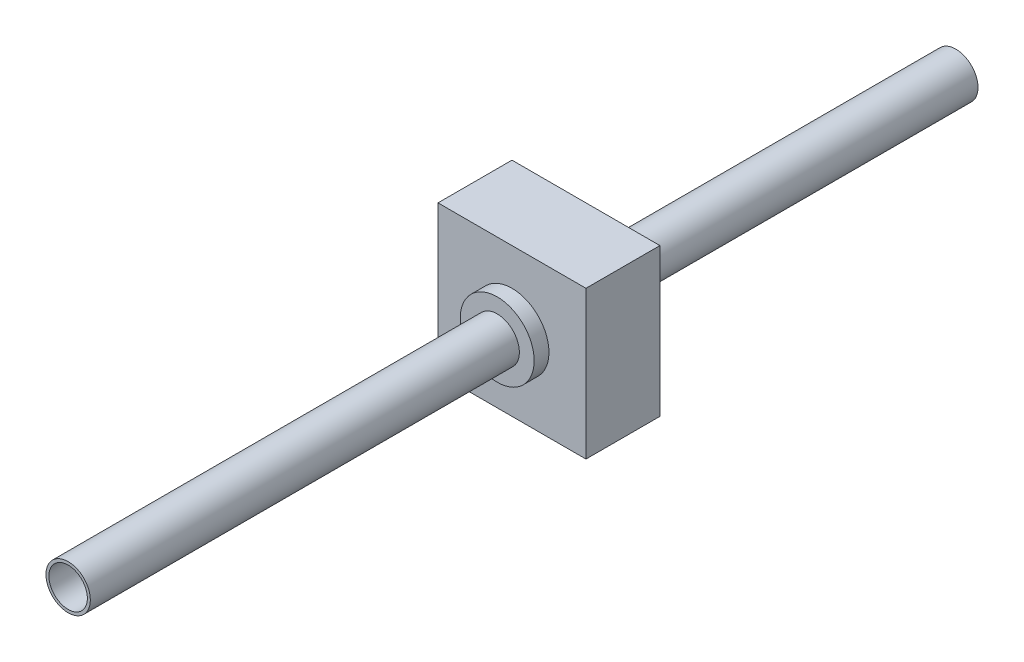
ISO-10303-21;
HEADER;
FILE_DESCRIPTION(('STEP AP214'),'2;1');
FILE_NAME('part.step','',(''),(''),'','','');
FILE_SCHEMA(('AUTOMOTIVE_DESIGN { 1 0 10303 214 1 1 1 1 }'));
ENDSEC;
DATA;
#1=APPLICATION_CONTEXT('core data for automotive mechanical design processes');
#2=APPLICATION_PROTOCOL_DEFINITION('international standard','automotive_design',2000,#1);
#3=PRODUCT_CONTEXT('',#1,'mechanical');
#4=PRODUCT('Part','Part','',(#3));
#5=PRODUCT_RELATED_PRODUCT_CATEGORY('part','',(#4));
#6=PRODUCT_DEFINITION_FORMATION('','',#4);
#7=PRODUCT_DEFINITION_CONTEXT('part definition',#1,'design');
#8=PRODUCT_DEFINITION('design','',#6,#7);
#9=PRODUCT_DEFINITION_SHAPE('','',#8);
#10=(LENGTH_UNIT() NAMED_UNIT(*) SI_UNIT(.MILLI.,.METRE.));
#11=(NAMED_UNIT(*) PLANE_ANGLE_UNIT() SI_UNIT($,.RADIAN.));
#12=(NAMED_UNIT(*) SI_UNIT($,.STERADIAN.) SOLID_ANGLE_UNIT());
#13=UNCERTAINTY_MEASURE_WITH_UNIT(LENGTH_MEASURE(1.E-05),#10,'distance_accuracy_value','');
#14=(GEOMETRIC_REPRESENTATION_CONTEXT(3) GLOBAL_UNCERTAINTY_ASSIGNED_CONTEXT((#13)) GLOBAL_UNIT_ASSIGNED_CONTEXT((#10,
#11,#12)) REPRESENTATION_CONTEXT('',''));
#15=CARTESIAN_POINT('',(0.,0.,0.));
#16=DIRECTION('',(0.,0.,1.));
#17=DIRECTION('',(1.,0.,0.));
#18=AXIS2_PLACEMENT_3D('',#15,#16,#17);
#19=CARTESIAN_POINT('',(0.,0.,-600.));
#20=DIRECTION('',(0.,0.,1.));
#21=DIRECTION('',(1.,0.,0.));
#22=AXIS2_PLACEMENT_3D('',#19,#20,#21);
#23=CYLINDRICAL_SURFACE('',#22,250.);
#24=CARTESIAN_POINT('',(0.,0.,-600.));
#25=DIRECTION('',(0.,0.,1.));
#26=DIRECTION('',(1.,0.,0.));
#27=AXIS2_PLACEMENT_3D('',#24,#25,#26);
#28=CIRCLE('',#27,250.);
#29=CARTESIAN_POINT('',(250.,0.,-600.));
#30=VERTEX_POINT('',#29);
#31=EDGE_CURVE('E11',#30,#30,#28,.T.);
#32=ORIENTED_EDGE('',*,*,#31,.T.);
#33=EDGE_LOOP('',(#32));
#34=FACE_BOUND('',#33,.T.);
#35=CARTESIAN_POINT('',(0.,0.,100.));
#36=DIRECTION('',(0.,0.,1.));
#37=DIRECTION('',(1.,0.,0.));
#38=AXIS2_PLACEMENT_3D('',#35,#36,#37);
#39=CIRCLE('',#38,250.);
#40=CARTESIAN_POINT('',(250.,0.,100.));
#41=VERTEX_POINT('',#40);
#42=EDGE_CURVE('E43',#41,#41,#39,.T.);
#43=ORIENTED_EDGE('',*,*,#42,.F.);
#44=EDGE_LOOP('',(#43));
#45=FACE_BOUND('',#44,.T.);
#46=ADVANCED_FACE('F40',(#34,#45),#23,.T.);
#47=CARTESIAN_POINT('',(0.,0.,-600.));
#48=DIRECTION('',(0.,0.,1.));
#49=DIRECTION('',(1.,0.,0.));
#50=AXIS2_PLACEMENT_3D('',#47,#48,#49);
#51=PLANE('',#50);
#52=CARTESIAN_POINT('',(0.,0.,-600.));
#53=DIRECTION('',(0.,0.,1.));
#54=DIRECTION('',(1.,0.,0.));
#55=AXIS2_PLACEMENT_3D('',#52,#53,#54);
#56=CIRCLE('',#55,150.);
#57=CARTESIAN_POINT('',(150.,0.,-600.));
#58=VERTEX_POINT('',#57);
#59=EDGE_CURVE('E50',#58,#58,#56,.T.);
#60=ORIENTED_EDGE('',*,*,#59,.T.);
#61=EDGE_LOOP('',(#60));
#62=FACE_BOUND('',#61,.T.);
#63=ORIENTED_EDGE('',*,*,#31,.F.);
#64=EDGE_LOOP('',(#63));
#65=FACE_BOUND('',#64,.T.);
#66=ADVANCED_FACE('F58',(#62,#65),#51,.F.);
#67=CARTESIAN_POINT('',(0.,0.,100.));
#68=DIRECTION('',(0.,0.,1.));
#69=DIRECTION('',(1.,0.,0.));
#70=AXIS2_PLACEMENT_3D('',#67,#68,#69);
#71=PLANE('',#70);
#72=CARTESIAN_POINT('',(0.,0.,100.));
#73=DIRECTION('',(0.,0.,1.));
#74=DIRECTION('',(1.,0.,0.));
#75=AXIS2_PLACEMENT_3D('',#72,#73,#74);
#76=CIRCLE('',#75,150.);
#77=CARTESIAN_POINT('',(150.,0.,100.));
#78=VERTEX_POINT('',#77);
#79=EDGE_CURVE('E52',#78,#78,#76,.T.);
#80=ORIENTED_EDGE('',*,*,#79,.F.);
#81=EDGE_LOOP('',(#80));
#82=FACE_BOUND('',#81,.T.);
#83=ORIENTED_EDGE('',*,*,#42,.T.);
#84=EDGE_LOOP('',(#83));
#85=FACE_BOUND('',#84,.T.);
#86=ADVANCED_FACE('F64',(#82,#85),#71,.T.);
#87=CARTESIAN_POINT('',(0.,0.,-600.));
#88=DIRECTION('',(0.,0.,1.));
#89=DIRECTION('',(1.,0.,0.));
#90=AXIS2_PLACEMENT_3D('',#87,#88,#89);
#91=CYLINDRICAL_SURFACE('',#90,150.);
#92=ORIENTED_EDGE('',*,*,#59,.F.);
#93=EDGE_LOOP('',(#92));
#94=FACE_BOUND('',#93,.T.);
#95=ORIENTED_EDGE('',*,*,#79,.T.);
#96=EDGE_LOOP('',(#95));
#97=FACE_BOUND('',#96,.T.);
#98=ADVANCED_FACE('F61',(#94,#97),#91,.F.);
#99=CLOSED_SHELL('',(#46,#66,#86,#98));
#100=MANIFOLD_SOLID_BREP('B2',#99);
#101=CARTESIAN_POINT('',(0.,0.,-3000.));
#102=DIRECTION('',(0.,0.,1.));
#103=DIRECTION('',(1.,0.,0.));
#104=AXIS2_PLACEMENT_3D('',#101,#102,#103);
#105=CYLINDRICAL_SURFACE('',#104,150.);
#106=CARTESIAN_POINT('',(0.,0.,-3000.));
#107=DIRECTION('',(0.,0.,1.));
#108=DIRECTION('',(1.,0.,0.));
#109=AXIS2_PLACEMENT_3D('',#106,#107,#108);
#110=CIRCLE('',#109,150.);
#111=CARTESIAN_POINT('',(150.,0.,-3000.));
#112=VERTEX_POINT('',#111);
#113=EDGE_CURVE('E39',#112,#112,#110,.T.);
#114=ORIENTED_EDGE('',*,*,#113,.T.);
#115=EDGE_LOOP('',(#114));
#116=FACE_BOUND('',#115,.T.);
#117=CARTESIAN_POINT('',(0.,0.,3000.));
#118=DIRECTION('',(0.,0.,1.));
#119=DIRECTION('',(1.,0.,0.));
#120=AXIS2_PLACEMENT_3D('',#117,#118,#119);
#121=CIRCLE('',#120,150.);
#122=CARTESIAN_POINT('',(150.,0.,3000.));
#123=VERTEX_POINT('',#122);
#124=EDGE_CURVE('E114',#123,#123,#121,.T.);
#125=ORIENTED_EDGE('',*,*,#124,.F.);
#126=EDGE_LOOP('',(#125));
#127=FACE_BOUND('',#126,.T.);
#128=ADVANCED_FACE('F111',(#116,#127),#105,.T.);
#129=CARTESIAN_POINT('',(0.,0.,-3000.));
#130=DIRECTION('',(0.,0.,1.));
#131=DIRECTION('',(1.,0.,0.));
#132=AXIS2_PLACEMENT_3D('',#129,#130,#131);
#133=PLANE('',#132);
#134=CARTESIAN_POINT('',(0.,0.,-3000.));
#135=DIRECTION('',(0.,0.,1.));
#136=DIRECTION('',(1.,0.,0.));
#137=AXIS2_PLACEMENT_3D('',#134,#135,#136);
#138=CIRCLE('',#137,130.);
#139=CARTESIAN_POINT('',(130.,0.,-3000.));
#140=VERTEX_POINT('',#139);
#141=EDGE_CURVE('E121',#140,#140,#138,.T.);
#142=ORIENTED_EDGE('',*,*,#141,.T.);
#143=EDGE_LOOP('',(#142));
#144=FACE_BOUND('',#143,.T.);
#145=ORIENTED_EDGE('',*,*,#113,.F.);
#146=EDGE_LOOP('',(#145));
#147=FACE_BOUND('',#146,.T.);
#148=ADVANCED_FACE('F129',(#144,#147),#133,.F.);
#149=CARTESIAN_POINT('',(0.,0.,3000.));
#150=DIRECTION('',(0.,0.,1.));
#151=DIRECTION('',(1.,0.,0.));
#152=AXIS2_PLACEMENT_3D('',#149,#150,#151);
#153=PLANE('',#152);
#154=CARTESIAN_POINT('',(0.,0.,3000.));
#155=DIRECTION('',(0.,0.,1.));
#156=DIRECTION('',(1.,0.,0.));
#157=AXIS2_PLACEMENT_3D('',#154,#155,#156);
#158=CIRCLE('',#157,130.);
#159=CARTESIAN_POINT('',(130.,0.,3000.));
#160=VERTEX_POINT('',#159);
#161=EDGE_CURVE('E123',#160,#160,#158,.T.);
#162=ORIENTED_EDGE('',*,*,#161,.F.);
#163=EDGE_LOOP('',(#162));
#164=FACE_BOUND('',#163,.T.);
#165=ORIENTED_EDGE('',*,*,#124,.T.);
#166=EDGE_LOOP('',(#165));
#167=FACE_BOUND('',#166,.T.);
#168=ADVANCED_FACE('F135',(#164,#167),#153,.T.);
#169=CARTESIAN_POINT('',(0.,0.,-3000.));
#170=DIRECTION('',(0.,0.,1.));
#171=DIRECTION('',(1.,0.,0.));
#172=AXIS2_PLACEMENT_3D('',#169,#170,#171);
#173=CYLINDRICAL_SURFACE('',#172,130.);
#174=ORIENTED_EDGE('',*,*,#141,.F.);
#175=EDGE_LOOP('',(#174));
#176=FACE_BOUND('',#175,.T.);
#177=ORIENTED_EDGE('',*,*,#161,.T.);
#178=EDGE_LOOP('',(#177));
#179=FACE_BOUND('',#178,.T.);
#180=ADVANCED_FACE('F132',(#176,#179),#173,.F.);
#181=CLOSED_SHELL('',(#128,#148,#168,#180));
#182=MANIFOLD_SOLID_BREP('B6',#181);
#183=CARTESIAN_POINT('',(500.,500.,-500.));
#184=DIRECTION('',(1.,0.,0.));
#185=DIRECTION('',(0.,1.,0.));
#186=AXIS2_PLACEMENT_3D('',#183,#184,#185);
#187=PLANE('',#186);
#188=DIRECTION('',(0.,1.,0.));
#189=VECTOR('',#188,1.);
#190=CARTESIAN_POINT('',(500.,500.,0.));
#191=LINE('',#190,#189);
#192=CARTESIAN_POINT('',(500.,-500.,0.));
#193=VERTEX_POINT('',#192);
#194=CARTESIAN_POINT('',(500.,500.,0.));
#195=VERTEX_POINT('',#194);
#196=EDGE_CURVE('E238',#193,#195,#191,.T.);
#197=ORIENTED_EDGE('',*,*,#196,.F.);
#198=DIRECTION('',(0.,0.,1.));
#199=VECTOR('',#198,1.);
#200=CARTESIAN_POINT('',(500.,-500.,-500.));
#201=LINE('',#200,#199);
#202=CARTESIAN_POINT('',(500.,-500.,-500.));
#203=VERTEX_POINT('',#202);
#204=EDGE_CURVE('E109',#203,#193,#201,.T.);
#205=ORIENTED_EDGE('',*,*,#204,.F.);
#206=DIRECTION('',(0.,1.,0.));
#207=VECTOR('',#206,1.);
#208=CARTESIAN_POINT('',(500.,500.,-500.));
#209=LINE('',#208,#207);
#210=CARTESIAN_POINT('',(500.,500.,-500.));
#211=VERTEX_POINT('',#210);
#212=EDGE_CURVE('E231',#203,#211,#209,.T.);
#213=ORIENTED_EDGE('',*,*,#212,.T.);
#214=DIRECTION('',(0.,0.,1.));
#215=VECTOR('',#214,1.);
#216=CARTESIAN_POINT('',(500.,500.,-500.));
#217=LINE('',#216,#215);
#218=EDGE_CURVE('E176',#211,#195,#217,.T.);
#219=ORIENTED_EDGE('',*,*,#218,.T.);
#220=EDGE_LOOP('',(#197,#205,#213,#219));
#221=FACE_BOUND('',#220,.T.);
#222=ADVANCED_FACE('F173',(#221),#187,.T.);
#223=CARTESIAN_POINT('',(-500.,-500.,-500.));
#224=DIRECTION('',(0.,-1.,0.));
#225=DIRECTION('',(0.,0.,-1.));
#226=AXIS2_PLACEMENT_3D('',#223,#224,#225);
#227=PLANE('',#226);
#228=DIRECTION('',(1.,0.,0.));
#229=VECTOR('',#228,1.);
#230=CARTESIAN_POINT('',(-500.,-500.,0.));
#231=LINE('',#230,#229);
#232=CARTESIAN_POINT('',(-500.,-500.,0.));
#233=VERTEX_POINT('',#232);
#234=EDGE_CURVE('E233',#233,#193,#231,.T.);
#235=ORIENTED_EDGE('',*,*,#234,.F.);
#236=DIRECTION('',(0.,0.,1.));
#237=VECTOR('',#236,1.);
#238=CARTESIAN_POINT('',(-500.,-500.,-500.));
#239=LINE('',#238,#237);
#240=CARTESIAN_POINT('',(-500.,-500.,-500.));
#241=VERTEX_POINT('',#240);
#242=EDGE_CURVE('E182',#241,#233,#239,.T.);
#243=ORIENTED_EDGE('',*,*,#242,.F.);
#244=DIRECTION('',(1.,0.,0.));
#245=VECTOR('',#244,1.);
#246=CARTESIAN_POINT('',(-500.,-500.,-500.));
#247=LINE('',#246,#245);
#248=EDGE_CURVE('E228',#241,#203,#247,.T.);
#249=ORIENTED_EDGE('',*,*,#248,.T.);
#250=ORIENTED_EDGE('',*,*,#204,.T.);
#251=EDGE_LOOP('',(#235,#243,#249,#250));
#252=FACE_BOUND('',#251,.T.);
#253=ADVANCED_FACE('F249',(#252),#227,.T.);
#254=CARTESIAN_POINT('',(-500.,500.,-500.));
#255=DIRECTION('',(-1.,0.,0.));
#256=DIRECTION('',(0.,-1.,0.));
#257=AXIS2_PLACEMENT_3D('',#254,#255,#256);
#258=PLANE('',#257);
#259=DIRECTION('',(0.,-1.,0.));
#260=VECTOR('',#259,1.);
#261=CARTESIAN_POINT('',(-500.,500.,0.));
#262=LINE('',#261,#260);
#263=CARTESIAN_POINT('',(-500.,500.,0.));
#264=VERTEX_POINT('',#263);
#265=EDGE_CURVE('E223',#264,#233,#262,.T.);
#266=ORIENTED_EDGE('',*,*,#265,.F.);
#267=DIRECTION('',(0.,0.,1.));
#268=VECTOR('',#267,1.);
#269=CARTESIAN_POINT('',(-500.,500.,-500.));
#270=LINE('',#269,#268);
#271=CARTESIAN_POINT('',(-500.,500.,-500.));
#272=VERTEX_POINT('',#271);
#273=EDGE_CURVE('E218',#272,#264,#270,.T.);
#274=ORIENTED_EDGE('',*,*,#273,.F.);
#275=DIRECTION('',(0.,-1.,0.));
#276=VECTOR('',#275,1.);
#277=CARTESIAN_POINT('',(-500.,500.,-500.));
#278=LINE('',#277,#276);
#279=EDGE_CURVE('E221',#272,#241,#278,.T.);
#280=ORIENTED_EDGE('',*,*,#279,.T.);
#281=ORIENTED_EDGE('',*,*,#242,.T.);
#282=EDGE_LOOP('',(#266,#274,#280,#281));
#283=FACE_BOUND('',#282,.T.);
#284=ADVANCED_FACE('F220',(#283),#258,.T.);
#285=CARTESIAN_POINT('',(-500.,500.,-500.));
#286=DIRECTION('',(0.,1.,0.));
#287=DIRECTION('',(0.,0.,1.));
#288=AXIS2_PLACEMENT_3D('',#285,#286,#287);
#289=PLANE('',#288);
#290=DIRECTION('',(-1.,0.,0.));
#291=VECTOR('',#290,1.);
#292=CARTESIAN_POINT('',(-500.,500.,0.));
#293=LINE('',#292,#291);
#294=EDGE_CURVE('E241',#195,#264,#293,.T.);
#295=ORIENTED_EDGE('',*,*,#294,.F.);
#296=ORIENTED_EDGE('',*,*,#218,.F.);
#297=DIRECTION('',(-1.,0.,0.));
#298=VECTOR('',#297,1.);
#299=CARTESIAN_POINT('',(-500.,500.,-500.));
#300=LINE('',#299,#298);
#301=EDGE_CURVE('E227',#211,#272,#300,.T.);
#302=ORIENTED_EDGE('',*,*,#301,.T.);
#303=ORIENTED_EDGE('',*,*,#273,.T.);
#304=EDGE_LOOP('',(#295,#296,#302,#303));
#305=FACE_BOUND('',#304,.T.);
#306=ADVANCED_FACE('F230',(#305),#289,.T.);
#307=CARTESIAN_POINT('',(0.,0.,-500.));
#308=DIRECTION('',(0.,0.,1.));
#309=DIRECTION('',(1.,0.,0.));
#310=AXIS2_PLACEMENT_3D('',#307,#308,#309);
#311=PLANE('',#310);
#312=CARTESIAN_POINT('',(-1.11022302462516E-13,1.11022302462516E-13,-500.));
#313=DIRECTION('',(0.,0.,1.));
#314=DIRECTION('',(1.,0.,0.));
#315=AXIS2_PLACEMENT_3D('',#312,#313,#314);
#316=CIRCLE('',#315,250.);
#317=CARTESIAN_POINT('',(250.,1.11022302462516E-13,-500.));
#318=VERTEX_POINT('',#317);
#319=EDGE_CURVE('E242',#318,#318,#316,.T.);
#320=ORIENTED_EDGE('',*,*,#319,.T.);
#321=EDGE_LOOP('',(#320));
#322=FACE_BOUND('',#321,.T.);
#323=ORIENTED_EDGE('',*,*,#212,.F.);
#324=ORIENTED_EDGE('',*,*,#248,.F.);
#325=ORIENTED_EDGE('',*,*,#279,.F.);
#326=ORIENTED_EDGE('',*,*,#301,.F.);
#327=EDGE_LOOP('',(#323,#324,#325,#326));
#328=FACE_BOUND('',#327,.T.);
#329=ADVANCED_FACE('F226',(#322,#328),#311,.F.);
#330=CARTESIAN_POINT('',(0.,0.,0.));
#331=DIRECTION('',(0.,0.,1.));
#332=DIRECTION('',(1.,0.,0.));
#333=AXIS2_PLACEMENT_3D('',#330,#331,#332);
#334=PLANE('',#333);
#335=CARTESIAN_POINT('',(-1.11022302462516E-13,1.11022302462516E-13,0.));
#336=DIRECTION('',(0.,0.,1.));
#337=DIRECTION('',(1.,0.,0.));
#338=AXIS2_PLACEMENT_3D('',#335,#336,#337);
#339=CIRCLE('',#338,250.);
#340=CARTESIAN_POINT('',(250.,1.11022302462516E-13,0.));
#341=VERTEX_POINT('',#340);
#342=EDGE_CURVE('E279',#341,#341,#339,.T.);
#343=ORIENTED_EDGE('',*,*,#342,.F.);
#344=EDGE_LOOP('',(#343));
#345=FACE_BOUND('',#344,.T.);
#346=ORIENTED_EDGE('',*,*,#196,.T.);
#347=ORIENTED_EDGE('',*,*,#294,.T.);
#348=ORIENTED_EDGE('',*,*,#265,.T.);
#349=ORIENTED_EDGE('',*,*,#234,.T.);
#350=EDGE_LOOP('',(#346,#347,#348,#349));
#351=FACE_BOUND('',#350,.T.);
#352=ADVANCED_FACE('F248',(#345,#351),#334,.T.);
#353=CARTESIAN_POINT('',(-1.11022302462516E-13,1.11022302462516E-13,-500.));
#354=DIRECTION('',(0.,0.,1.));
#355=DIRECTION('',(1.,0.,0.));
#356=AXIS2_PLACEMENT_3D('',#353,#354,#355);
#357=CYLINDRICAL_SURFACE('',#356,250.);
#358=ORIENTED_EDGE('',*,*,#319,.F.);
#359=EDGE_LOOP('',(#358));
#360=FACE_BOUND('',#359,.T.);
#361=ORIENTED_EDGE('',*,*,#342,.T.);
#362=EDGE_LOOP('',(#361));
#363=FACE_BOUND('',#362,.T.);
#364=ADVANCED_FACE('F267',(#360,#363),#357,.F.);
#365=CLOSED_SHELL('',(#222,#253,#284,#306,#329,#352,#364));
#366=MANIFOLD_SOLID_BREP('B34',#365);
#367=ADVANCED_BREP_SHAPE_REPRESENTATION('',(#18,#100,#182,#366),#14);
#368=SHAPE_DEFINITION_REPRESENTATION(#9,#367);
ENDSEC;
END-ISO-10303-21;
